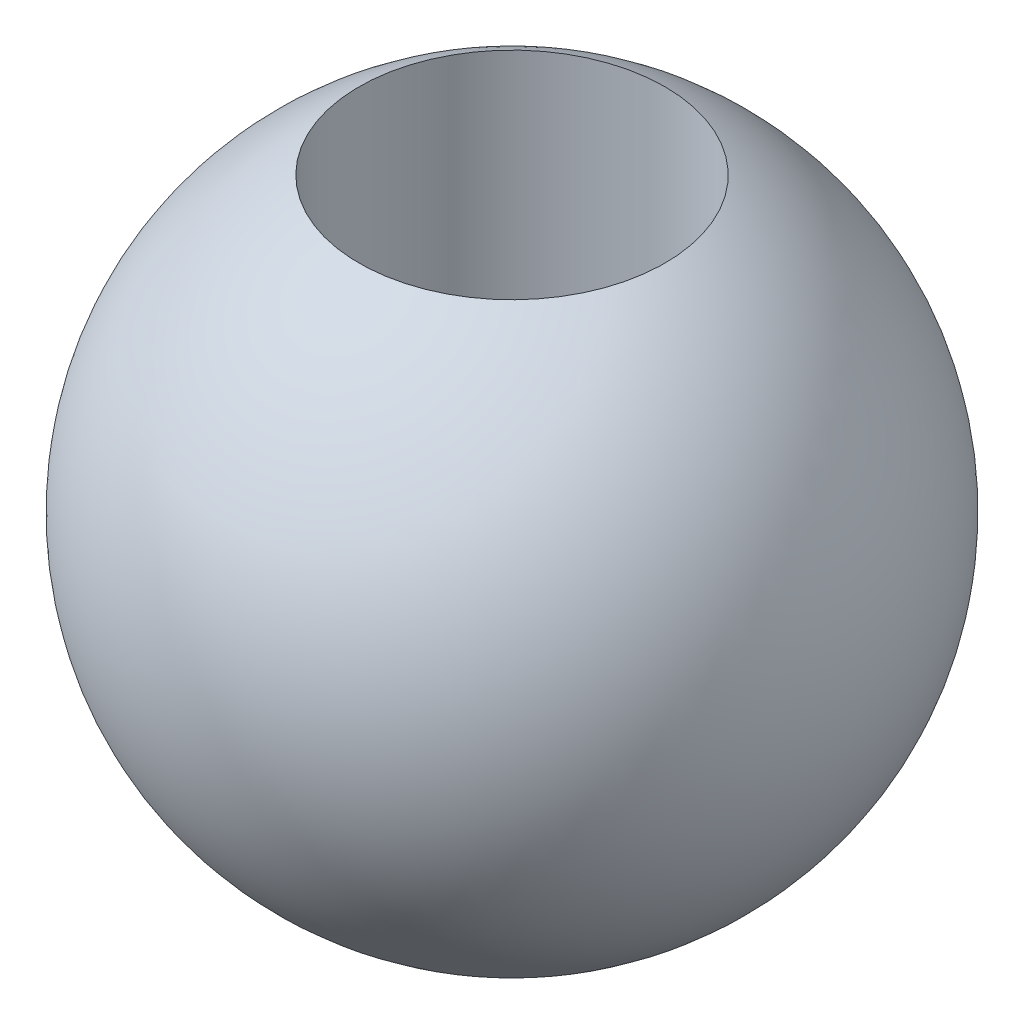
ISO-10303-21;
HEADER;
FILE_DESCRIPTION(('STEP AP214'),'2;1');
FILE_NAME('part.step','',(''),(''),'','','');
FILE_SCHEMA(('AUTOMOTIVE_DESIGN { 1 0 10303 214 1 1 1 1 }'));
ENDSEC;
DATA;
#1=APPLICATION_CONTEXT('core data for automotive mechanical design processes');
#2=APPLICATION_PROTOCOL_DEFINITION('international standard','automotive_design',2000,#1);
#3=PRODUCT_CONTEXT('',#1,'mechanical');
#4=PRODUCT('Part','Part','',(#3));
#5=PRODUCT_RELATED_PRODUCT_CATEGORY('part','',(#4));
#6=PRODUCT_DEFINITION_FORMATION('','',#4);
#7=PRODUCT_DEFINITION_CONTEXT('part definition',#1,'design');
#8=PRODUCT_DEFINITION('design','',#6,#7);
#9=PRODUCT_DEFINITION_SHAPE('','',#8);
#10=(LENGTH_UNIT() NAMED_UNIT(*) SI_UNIT(.MILLI.,.METRE.));
#11=(NAMED_UNIT(*) PLANE_ANGLE_UNIT() SI_UNIT($,.RADIAN.));
#12=(NAMED_UNIT(*) SI_UNIT($,.STERADIAN.) SOLID_ANGLE_UNIT());
#13=UNCERTAINTY_MEASURE_WITH_UNIT(LENGTH_MEASURE(1.E-05),#10,'distance_accuracy_value','');
#14=(GEOMETRIC_REPRESENTATION_CONTEXT(3) GLOBAL_UNCERTAINTY_ASSIGNED_CONTEXT((#13)) GLOBAL_UNIT_ASSIGNED_CONTEXT((#10,
#11,#12)) REPRESENTATION_CONTEXT('',''));
#15=CARTESIAN_POINT('',(0.,0.,0.));
#16=DIRECTION('',(0.,0.,1.));
#17=DIRECTION('',(1.,0.,0.));
#18=AXIS2_PLACEMENT_3D('',#15,#16,#17);
#19=CARTESIAN_POINT('',(0.,0.,0.));
#20=DIRECTION('',(0.,-1.,0.));
#21=DIRECTION('',(0.,0.,1.));
#22=AXIS2_PLACEMENT_3D('',#19,#20,#21);
#23=SPHERICAL_SURFACE('',#22,3.175);
#24=CARTESIAN_POINT('',(0.,-2.812526757206,0.));
#25=DIRECTION('',(0.,-1.,0.));
#26=DIRECTION('',(0.,0.,-1.));
#27=AXIS2_PLACEMENT_3D('',#24,#25,#26);
#28=CIRCLE('',#27,1.47320000000001);
#29=CARTESIAN_POINT('',(0.,-2.812526757206,-1.47320000000002));
#30=VERTEX_POINT('',#29);
#31=EDGE_CURVE('E34',#30,#30,#28,.T.);
#32=ORIENTED_EDGE('',*,*,#31,.F.);
#33=EDGE_LOOP('',(#32));
#34=FACE_BOUND('',#33,.T.);
#35=CARTESIAN_POINT('',(0.,2.81252675720611,0.));
#36=DIRECTION('',(0.,-1.,0.));
#37=DIRECTION('',(0.,0.,-1.));
#38=AXIS2_PLACEMENT_3D('',#35,#36,#37);
#39=CIRCLE('',#38,1.47319999999999);
#40=CARTESIAN_POINT('',(0.,2.81252675720612,-1.47319999999998));
#41=VERTEX_POINT('',#40);
#42=EDGE_CURVE('E10',#41,#41,#39,.T.);
#43=ORIENTED_EDGE('',*,*,#42,.T.);
#44=EDGE_LOOP('',(#43));
#45=FACE_BOUND('',#44,.T.);
#46=ADVANCED_FACE('F28',(#34,#45),#23,.T.);
#47=CARTESIAN_POINT('',(0.,-1000.,-3.49148133884313E-12));
#48=DIRECTION('',(0.,-1.,0.));
#49=DIRECTION('',(0.,0.,-1.));
#50=AXIS2_PLACEMENT_3D('',#47,#48,#49);
#51=CYLINDRICAL_SURFACE('',#50,1.4732);
#52=ORIENTED_EDGE('',*,*,#42,.F.);
#53=EDGE_LOOP('',(#52));
#54=FACE_BOUND('',#53,.T.);
#55=ORIENTED_EDGE('',*,*,#31,.T.);
#56=EDGE_LOOP('',(#55));
#57=FACE_BOUND('',#56,.T.);
#58=ADVANCED_FACE('F40',(#54,#57),#51,.F.);
#59=CLOSED_SHELL('',(#46,#58));
#60=MANIFOLD_SOLID_BREP('B2',#59);
#61=ADVANCED_BREP_SHAPE_REPRESENTATION('',(#18,#60),#14);
#62=SHAPE_DEFINITION_REPRESENTATION(#9,#61);
ENDSEC;
END-ISO-10303-21;
